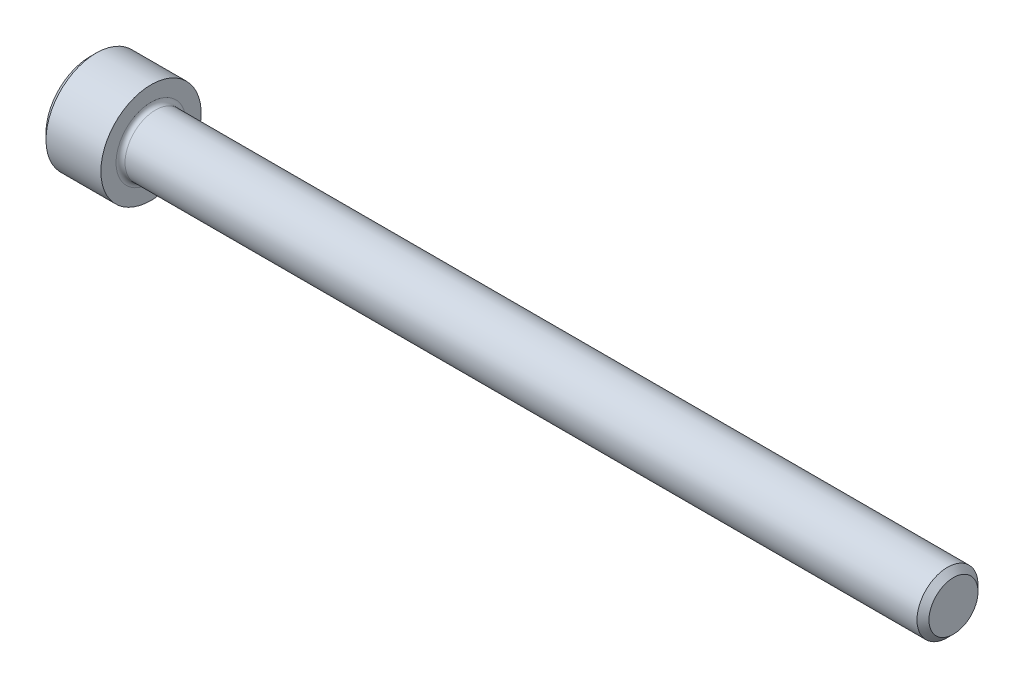
ISO-10303-21;
HEADER;
FILE_DESCRIPTION(('STEP AP214'),'2;1');
FILE_NAME('part.step','',(''),(''),'','','');
FILE_SCHEMA(('AUTOMOTIVE_DESIGN { 1 0 10303 214 1 1 1 1 }'));
ENDSEC;
DATA;
#1=APPLICATION_CONTEXT('core data for automotive mechanical design processes');
#2=APPLICATION_PROTOCOL_DEFINITION('international standard','automotive_design',2000,#1);
#3=PRODUCT_CONTEXT('',#1,'mechanical');
#4=PRODUCT('Part','Part','',(#3));
#5=PRODUCT_RELATED_PRODUCT_CATEGORY('part','',(#4));
#6=PRODUCT_DEFINITION_FORMATION('','',#4);
#7=PRODUCT_DEFINITION_CONTEXT('part definition',#1,'design');
#8=PRODUCT_DEFINITION('design','',#6,#7);
#9=PRODUCT_DEFINITION_SHAPE('','',#8);
#10=(LENGTH_UNIT() NAMED_UNIT(*) SI_UNIT(.MILLI.,.METRE.));
#11=(NAMED_UNIT(*) PLANE_ANGLE_UNIT() SI_UNIT($,.RADIAN.));
#12=(NAMED_UNIT(*) SI_UNIT($,.STERADIAN.) SOLID_ANGLE_UNIT());
#13=UNCERTAINTY_MEASURE_WITH_UNIT(LENGTH_MEASURE(1.E-05),#10,'distance_accuracy_value','');
#14=(GEOMETRIC_REPRESENTATION_CONTEXT(3) GLOBAL_UNCERTAINTY_ASSIGNED_CONTEXT((#13)) GLOBAL_UNIT_ASSIGNED_CONTEXT((#10,
#11,#12)) REPRESENTATION_CONTEXT('',''));
#15=CARTESIAN_POINT('',(0.,0.,0.));
#16=DIRECTION('',(0.,0.,1.));
#17=DIRECTION('',(1.,0.,0.));
#18=AXIS2_PLACEMENT_3D('',#15,#16,#17);
#19=CARTESIAN_POINT('',(2.286,1.14604605784411,1.98501));
#20=DIRECTION('',(-1.,0.,0.));
#21=DIRECTION('',(0.,0.,1.));
#22=AXIS2_PLACEMENT_3D('',#19,#20,#21);
#23=PLANE('',#22);
#24=DIRECTION('',(0.,0.500000000000001,0.866025403784438));
#25=VECTOR('',#24,1.);
#26=CARTESIAN_POINT('',(2.286,-1.71906908676614,0.992505));
#27=LINE('',#26,#25);
#28=CARTESIAN_POINT('',(2.2859999999804,-1.71906908679011,0.992505000013839));
#29=VERTEX_POINT('',#28);
#30=CARTESIAN_POINT('',(2.286,-1.14604605784409,1.98501));
#31=VERTEX_POINT('',#30);
#32=EDGE_CURVE('E101',#29,#31,#27,.T.);
#33=ORIENTED_EDGE('',*,*,#32,.T.);
#34=DIRECTION('',(0.,1.,0.));
#35=VECTOR('',#34,1.);
#36=CARTESIAN_POINT('',(2.286,1.14604605784411,1.98501));
#37=LINE('',#36,#35);
#38=CARTESIAN_POINT('',(2.28599999998701,0.,1.98501000001309));
#39=VERTEX_POINT('',#38);
#40=EDGE_CURVE('E96',#31,#39,#37,.T.);
#41=ORIENTED_EDGE('',*,*,#40,.T.);
#42=CARTESIAN_POINT('',(2.2859999999608,0.,0.));
#43=DIRECTION('',(-1.,0.,0.));
#44=DIRECTION('',(0.,0.,1.));
#45=AXIS2_PLACEMENT_3D('',#42,#43,#44);
#46=CIRCLE('',#45,1.98501000005535);
#47=EDGE_CURVE('E98',#39,#29,#46,.F.);
#48=ORIENTED_EDGE('',*,*,#47,.T.);
#49=EDGE_LOOP('',(#33,#41,#48));
#50=FACE_BOUND('',#49,.T.);
#51=ADVANCED_FACE('F17',(#50),#23,.T.);
#52=CARTESIAN_POINT('',(2.286,1.14604605784411,1.98501));
#53=DIRECTION('',(-1.,0.,0.));
#54=DIRECTION('',(0.,0.,1.));
#55=AXIS2_PLACEMENT_3D('',#52,#53,#54);
#56=PLANE('',#55);
#57=DIRECTION('',(0.,-0.499999999999998,0.86602540378444));
#58=VECTOR('',#57,1.);
#59=CARTESIAN_POINT('',(2.286,-1.71906908676615,-0.992504999999996));
#60=LINE('',#59,#58);
#61=CARTESIAN_POINT('',(2.2859999999804,-1.71906908679012,-0.992505000013836));
#62=VERTEX_POINT('',#61);
#63=CARTESIAN_POINT('',(2.286,-2.29209211568819,0.));
#64=VERTEX_POINT('',#63);
#65=EDGE_CURVE('E105',#62,#64,#60,.T.);
#66=ORIENTED_EDGE('',*,*,#65,.T.);
#67=DIRECTION('',(0.,0.500000000000001,0.866025403784438));
#68=VECTOR('',#67,1.);
#69=CARTESIAN_POINT('',(2.286,-2.29209211568819,0.));
#70=LINE('',#69,#68);
#71=EDGE_CURVE('E172',#64,#29,#70,.T.);
#72=ORIENTED_EDGE('',*,*,#71,.T.);
#73=CARTESIAN_POINT('',(2.2859999999608,0.,0.));
#74=DIRECTION('',(-1.,0.,0.));
#75=DIRECTION('',(0.,0.,1.));
#76=AXIS2_PLACEMENT_3D('',#73,#74,#75);
#77=CIRCLE('',#76,1.98501000005535);
#78=EDGE_CURVE('E117',#29,#62,#77,.F.);
#79=ORIENTED_EDGE('',*,*,#78,.T.);
#80=EDGE_LOOP('',(#66,#72,#79));
#81=FACE_BOUND('',#80,.T.);
#82=ADVANCED_FACE('F348',(#81),#56,.T.);
#83=CARTESIAN_POINT('',(2.286,1.14604605784411,1.98501));
#84=DIRECTION('',(-1.,0.,0.));
#85=DIRECTION('',(0.,0.,1.));
#86=AXIS2_PLACEMENT_3D('',#83,#84,#85);
#87=PLANE('',#86);
#88=DIRECTION('',(0.,1.,0.));
#89=VECTOR('',#88,1.);
#90=CARTESIAN_POINT('',(2.286,1.14604605784411,-1.98501));
#91=LINE('',#90,#89);
#92=CARTESIAN_POINT('',(2.28599999998701,0.,-1.98501000001309));
#93=VERTEX_POINT('',#92);
#94=CARTESIAN_POINT('',(2.286,-1.1460460578441,-1.98501));
#95=VERTEX_POINT('',#94);
#96=EDGE_CURVE('E167',#93,#95,#91,.F.);
#97=ORIENTED_EDGE('',*,*,#96,.T.);
#98=DIRECTION('',(0.,-0.499999999999999,0.866025403784439));
#99=VECTOR('',#98,1.);
#100=CARTESIAN_POINT('',(2.286,-1.1460460578441,-1.98501));
#101=LINE('',#100,#99);
#102=EDGE_CURVE('E162',#95,#62,#101,.T.);
#103=ORIENTED_EDGE('',*,*,#102,.T.);
#104=CARTESIAN_POINT('',(2.2859999999608,0.,0.));
#105=DIRECTION('',(-1.,0.,0.));
#106=DIRECTION('',(0.,0.,1.));
#107=AXIS2_PLACEMENT_3D('',#104,#105,#106);
#108=CIRCLE('',#107,1.98501000005535);
#109=EDGE_CURVE('E225',#62,#93,#108,.F.);
#110=ORIENTED_EDGE('',*,*,#109,.T.);
#111=EDGE_LOOP('',(#97,#103,#110));
#112=FACE_BOUND('',#111,.T.);
#113=ADVANCED_FACE('F345',(#112),#87,.T.);
#114=CARTESIAN_POINT('',(2.286,1.14604605784411,1.98501));
#115=DIRECTION('',(-1.,0.,0.));
#116=DIRECTION('',(0.,0.,1.));
#117=AXIS2_PLACEMENT_3D('',#114,#115,#116);
#118=PLANE('',#117);
#119=DIRECTION('',(0.,-0.500000000000001,-0.866025403784438));
#120=VECTOR('',#119,1.);
#121=CARTESIAN_POINT('',(2.286,1.71906908676615,-0.992505000000006));
#122=LINE('',#121,#120);
#123=CARTESIAN_POINT('',(2.2859999999804,1.71906908679012,-0.992505000013843));
#124=VERTEX_POINT('',#123);
#125=CARTESIAN_POINT('',(2.286,1.1460460578441,-1.98501));
#126=VERTEX_POINT('',#125);
#127=EDGE_CURVE('E157',#124,#126,#122,.T.);
#128=ORIENTED_EDGE('',*,*,#127,.T.);
#129=DIRECTION('',(0.,1.,0.));
#130=VECTOR('',#129,1.);
#131=CARTESIAN_POINT('',(2.286,1.14604605784411,-1.98501));
#132=LINE('',#131,#130);
#133=EDGE_CURVE('E152',#126,#93,#132,.F.);
#134=ORIENTED_EDGE('',*,*,#133,.T.);
#135=CARTESIAN_POINT('',(2.2859999999608,0.,0.));
#136=DIRECTION('',(-1.,0.,0.));
#137=DIRECTION('',(0.,0.,1.));
#138=AXIS2_PLACEMENT_3D('',#135,#136,#137);
#139=CIRCLE('',#138,1.98501000005535);
#140=EDGE_CURVE('E222',#93,#124,#139,.F.);
#141=ORIENTED_EDGE('',*,*,#140,.T.);
#142=EDGE_LOOP('',(#128,#134,#141));
#143=FACE_BOUND('',#142,.T.);
#144=ADVANCED_FACE('F341',(#143),#118,.T.);
#145=CARTESIAN_POINT('',(2.286,1.14604605784411,1.98501));
#146=DIRECTION('',(-1.,0.,0.));
#147=DIRECTION('',(0.,0.,1.));
#148=AXIS2_PLACEMENT_3D('',#145,#146,#147);
#149=PLANE('',#148);
#150=DIRECTION('',(0.,0.500000000000002,-0.866025403784437));
#151=VECTOR('',#150,1.);
#152=CARTESIAN_POINT('',(2.286,1.71906908676615,0.992504999999996));
#153=LINE('',#152,#151);
#154=CARTESIAN_POINT('',(2.2859999999804,1.71906908679012,0.992505000013835));
#155=VERTEX_POINT('',#154);
#156=CARTESIAN_POINT('',(2.286,2.2920921156882,0.));
#157=VERTEX_POINT('',#156);
#158=EDGE_CURVE('E147',#155,#157,#153,.T.);
#159=ORIENTED_EDGE('',*,*,#158,.T.);
#160=DIRECTION('',(0.,-0.500000000000002,-0.866025403784437));
#161=VECTOR('',#160,1.);
#162=CARTESIAN_POINT('',(2.286,2.2920921156882,0.));
#163=LINE('',#162,#161);
#164=EDGE_CURVE('E118',#157,#124,#163,.T.);
#165=ORIENTED_EDGE('',*,*,#164,.T.);
#166=CARTESIAN_POINT('',(2.2859999999608,0.,0.));
#167=DIRECTION('',(-1.,0.,0.));
#168=DIRECTION('',(0.,0.,1.));
#169=AXIS2_PLACEMENT_3D('',#166,#167,#168);
#170=CIRCLE('',#169,1.98501000005535);
#171=EDGE_CURVE('E125',#124,#155,#170,.F.);
#172=ORIENTED_EDGE('',*,*,#171,.T.);
#173=EDGE_LOOP('',(#159,#165,#172));
#174=FACE_BOUND('',#173,.T.);
#175=ADVANCED_FACE('F337',(#174),#149,.T.);
#176=CARTESIAN_POINT('',(2.28600000002643,0.,0.));
#177=DIRECTION('',(-1.,0.,0.));
#178=DIRECTION('',(0.,0.,1.));
#179=AXIS2_PLACEMENT_3D('',#176,#177,#178);
#180=CONICAL_SURFACE('',#179,1.98500999994167,1.04719755112655);
#181=CARTESIAN_POINT('',(3.43204605781011,0.,5.6843418860808E-11));
#182=VERTEX_POINT('',#181);
#183=VERTEX_LOOP('',#182);
#184=FACE_BOUND('',#183,.T.);
#185=ORIENTED_EDGE('',*,*,#47,.F.);
#186=CARTESIAN_POINT('',(2.2859999999608,0.,0.));
#187=DIRECTION('',(-1.,0.,0.));
#188=DIRECTION('',(0.,0.,1.));
#189=AXIS2_PLACEMENT_3D('',#186,#187,#188);
#190=CIRCLE('',#189,1.98501000005535);
#191=EDGE_CURVE('E113',#155,#39,#190,.F.);
#192=ORIENTED_EDGE('',*,*,#191,.F.);
#193=ORIENTED_EDGE('',*,*,#171,.F.);
#194=ORIENTED_EDGE('',*,*,#140,.F.);
#195=ORIENTED_EDGE('',*,*,#109,.F.);
#196=ORIENTED_EDGE('',*,*,#78,.F.);
#197=EDGE_LOOP('',(#185,#192,#193,#194,#195,#196));
#198=FACE_BOUND('',#197,.T.);
#199=ADVANCED_FACE('F111',(#184,#198),#180,.F.);
#200=CARTESIAN_POINT('',(2.286,1.14604605784411,1.98501));
#201=DIRECTION('',(-1.,0.,0.));
#202=DIRECTION('',(0.,0.,1.));
#203=AXIS2_PLACEMENT_3D('',#200,#201,#202);
#204=PLANE('',#203);
#205=DIRECTION('',(0.,-1.,0.));
#206=VECTOR('',#205,1.);
#207=CARTESIAN_POINT('',(2.286,-1.14604605784409,1.98501));
#208=LINE('',#207,#206);
#209=CARTESIAN_POINT('',(2.286,1.14604605784411,1.98501));
#210=VERTEX_POINT('',#209);
#211=EDGE_CURVE('E122',#39,#210,#208,.F.);
#212=ORIENTED_EDGE('',*,*,#211,.T.);
#213=DIRECTION('',(0.,0.499999999999998,-0.86602540378444));
#214=VECTOR('',#213,1.);
#215=CARTESIAN_POINT('',(2.286,2.2920921156882,0.));
#216=LINE('',#215,#214);
#217=EDGE_CURVE('E124',#155,#210,#216,.F.);
#218=ORIENTED_EDGE('',*,*,#217,.F.);
#219=ORIENTED_EDGE('',*,*,#191,.T.);
#220=EDGE_LOOP('',(#212,#218,#219));
#221=FACE_BOUND('',#220,.T.);
#222=ADVANCED_FACE('F121',(#221),#204,.T.);
#223=CARTESIAN_POINT('',(2.286,2.2920921156882,0.));
#224=DIRECTION('',(0.,-0.86602540378444,-0.499999999999998));
#225=DIRECTION('',(0.,0.499999999999998,-0.86602540378444));
#226=AXIS2_PLACEMENT_3D('',#223,#224,#225);
#227=PLANE('',#226);
#228=ORIENTED_EDGE('',*,*,#217,.T.);
#229=DIRECTION('',(1.,0.,0.));
#230=VECTOR('',#229,1.);
#231=CARTESIAN_POINT('',(2.286,1.14604605784411,1.98501));
#232=LINE('',#231,#230);
#233=CARTESIAN_POINT('',(0.,1.14604605784411,1.98501));
#234=VERTEX_POINT('',#233);
#235=EDGE_CURVE('E130',#210,#234,#232,.F.);
#236=ORIENTED_EDGE('',*,*,#235,.T.);
#237=DIRECTION('',(0.,-0.499999999999998,0.86602540378444));
#238=VECTOR('',#237,1.);
#239=CARTESIAN_POINT('',(0.,2.2920921156882,0.));
#240=LINE('',#239,#238);
#241=CARTESIAN_POINT('',(0.,2.2920921156882,0.));
#242=VERTEX_POINT('',#241);
#243=EDGE_CURVE('E137',#242,#234,#240,.T.);
#244=ORIENTED_EDGE('',*,*,#243,.F.);
#245=DIRECTION('',(1.,0.,0.));
#246=VECTOR('',#245,1.);
#247=CARTESIAN_POINT('',(2.286,2.2920921156882,0.));
#248=LINE('',#247,#246);
#249=EDGE_CURVE('E187',#242,#157,#248,.T.);
#250=ORIENTED_EDGE('',*,*,#249,.T.);
#251=ORIENTED_EDGE('',*,*,#158,.F.);
#252=EDGE_LOOP('',(#228,#236,#244,#250,#251));
#253=FACE_BOUND('',#252,.T.);
#254=ADVANCED_FACE('F329',(#253),#227,.T.);
#255=CARTESIAN_POINT('',(2.286,-1.14604605784409,1.98501));
#256=DIRECTION('',(0.,0.,1.));
#257=DIRECTION('',(0.,-1.,0.));
#258=AXIS2_PLACEMENT_3D('',#255,#256,#257);
#259=PLANE('',#258);
#260=ORIENTED_EDGE('',*,*,#235,.F.);
#261=ORIENTED_EDGE('',*,*,#211,.F.);
#262=ORIENTED_EDGE('',*,*,#40,.F.);
#263=DIRECTION('',(1.,0.,0.));
#264=VECTOR('',#263,1.);
#265=CARTESIAN_POINT('',(2.286,-1.14604605784409,1.98501));
#266=LINE('',#265,#264);
#267=CARTESIAN_POINT('',(0.,-1.14604605784409,1.98501));
#268=VERTEX_POINT('',#267);
#269=EDGE_CURVE('E132',#268,#31,#266,.T.);
#270=ORIENTED_EDGE('',*,*,#269,.F.);
#271=DIRECTION('',(0.,1.,0.));
#272=VECTOR('',#271,1.);
#273=CARTESIAN_POINT('',(0.,0.,1.98501));
#274=LINE('',#273,#272);
#275=EDGE_CURVE('E363',#234,#268,#274,.F.);
#276=ORIENTED_EDGE('',*,*,#275,.F.);
#277=EDGE_LOOP('',(#260,#261,#262,#270,#276));
#278=FACE_BOUND('',#277,.T.);
#279=ADVANCED_FACE('F128',(#278),#259,.F.);
#280=CARTESIAN_POINT('',(2.286,-1.14604605784409,1.98501));
#281=DIRECTION('',(0.,0.866025403784438,-0.500000000000001));
#282=DIRECTION('',(0.,0.500000000000001,0.866025403784438));
#283=AXIS2_PLACEMENT_3D('',#280,#281,#282);
#284=PLANE('',#283);
#285=ORIENTED_EDGE('',*,*,#71,.F.);
#286=DIRECTION('',(1.,0.,0.));
#287=VECTOR('',#286,1.);
#288=CARTESIAN_POINT('',(2.286,-2.29209211568819,0.));
#289=LINE('',#288,#287);
#290=CARTESIAN_POINT('',(0.,-2.29209211568819,0.));
#291=VERTEX_POINT('',#290);
#292=EDGE_CURVE('E198',#291,#64,#289,.T.);
#293=ORIENTED_EDGE('',*,*,#292,.F.);
#294=DIRECTION('',(0.,-0.500000000000001,-0.866025403784438));
#295=VECTOR('',#294,1.);
#296=CARTESIAN_POINT('',(0.,-1.14604605784409,1.98501));
#297=LINE('',#296,#295);
#298=EDGE_CURVE('E361',#268,#291,#297,.T.);
#299=ORIENTED_EDGE('',*,*,#298,.F.);
#300=ORIENTED_EDGE('',*,*,#269,.T.);
#301=ORIENTED_EDGE('',*,*,#32,.F.);
#302=EDGE_LOOP('',(#285,#293,#299,#300,#301));
#303=FACE_BOUND('',#302,.T.);
#304=ADVANCED_FACE('F322',(#303),#284,.T.);
#305=CARTESIAN_POINT('',(2.286,-2.29209211568819,0.));
#306=DIRECTION('',(0.,0.866025403784439,0.499999999999999));
#307=DIRECTION('',(0.,-0.499999999999999,0.866025403784439));
#308=AXIS2_PLACEMENT_3D('',#305,#306,#307);
#309=PLANE('',#308);
#310=ORIENTED_EDGE('',*,*,#102,.F.);
#311=DIRECTION('',(1.,0.,0.));
#312=VECTOR('',#311,1.);
#313=CARTESIAN_POINT('',(2.286,-1.1460460578441,-1.98501));
#314=LINE('',#313,#312);
#315=CARTESIAN_POINT('',(0.,-1.1460460578441,-1.98501));
#316=VERTEX_POINT('',#315);
#317=EDGE_CURVE('E191',#95,#316,#314,.F.);
#318=ORIENTED_EDGE('',*,*,#317,.T.);
#319=DIRECTION('',(0.,0.499999999999999,-0.86602540378444));
#320=VECTOR('',#319,1.);
#321=CARTESIAN_POINT('',(0.,-2.29209211568819,0.));
#322=LINE('',#321,#320);
#323=EDGE_CURVE('E358',#291,#316,#322,.T.);
#324=ORIENTED_EDGE('',*,*,#323,.F.);
#325=ORIENTED_EDGE('',*,*,#292,.T.);
#326=ORIENTED_EDGE('',*,*,#65,.F.);
#327=EDGE_LOOP('',(#310,#318,#324,#325,#326));
#328=FACE_BOUND('',#327,.T.);
#329=ADVANCED_FACE('F318',(#328),#309,.T.);
#330=CARTESIAN_POINT('',(2.286,1.1460460578441,-1.98501));
#331=DIRECTION('',(0.,0.,-1.));
#332=DIRECTION('',(0.,1.,0.));
#333=AXIS2_PLACEMENT_3D('',#330,#331,#332);
#334=PLANE('',#333);
#335=ORIENTED_EDGE('',*,*,#317,.F.);
#336=ORIENTED_EDGE('',*,*,#96,.F.);
#337=ORIENTED_EDGE('',*,*,#133,.F.);
#338=DIRECTION('',(1.,0.,0.));
#339=VECTOR('',#338,1.);
#340=CARTESIAN_POINT('',(2.286,1.1460460578441,-1.98501));
#341=LINE('',#340,#339);
#342=CARTESIAN_POINT('',(0.,1.1460460578441,-1.98501));
#343=VERTEX_POINT('',#342);
#344=EDGE_CURVE('E190',#126,#343,#341,.F.);
#345=ORIENTED_EDGE('',*,*,#344,.T.);
#346=DIRECTION('',(0.,1.,0.));
#347=VECTOR('',#346,1.);
#348=CARTESIAN_POINT('',(0.,0.,-1.98501));
#349=LINE('',#348,#347);
#350=EDGE_CURVE('E373',#316,#343,#349,.T.);
#351=ORIENTED_EDGE('',*,*,#350,.F.);
#352=EDGE_LOOP('',(#335,#336,#337,#345,#351));
#353=FACE_BOUND('',#352,.T.);
#354=ADVANCED_FACE('F314',(#353),#334,.F.);
#355=CARTESIAN_POINT('',(2.286,2.2920921156882,0.));
#356=DIRECTION('',(0.,0.866025403784438,-0.500000000000002));
#357=DIRECTION('',(0.,0.500000000000002,0.866025403784438));
#358=AXIS2_PLACEMENT_3D('',#355,#356,#357);
#359=PLANE('',#358);
#360=ORIENTED_EDGE('',*,*,#344,.F.);
#361=ORIENTED_EDGE('',*,*,#127,.F.);
#362=ORIENTED_EDGE('',*,*,#164,.F.);
#363=ORIENTED_EDGE('',*,*,#249,.F.);
#364=DIRECTION('',(0.,0.500000000000002,0.866025403784438));
#365=VECTOR('',#364,1.);
#366=CARTESIAN_POINT('',(0.,1.1460460578441,-1.98501));
#367=LINE('',#366,#365);
#368=EDGE_CURVE('E218',#343,#242,#367,.T.);
#369=ORIENTED_EDGE('',*,*,#368,.F.);
#370=EDGE_LOOP('',(#360,#361,#362,#363,#369));
#371=FACE_BOUND('',#370,.T.);
#372=ADVANCED_FACE('F310',(#371),#359,.F.);
#373=CARTESIAN_POINT('',(0.,0.,0.));
#374=DIRECTION('',(-1.,0.,0.));
#375=DIRECTION('',(0.,0.,1.));
#376=AXIS2_PLACEMENT_3D('',#373,#374,#375);
#377=PLANE('',#376);
#378=CARTESIAN_POINT('',(-5.6843418860808E-11,0.,0.));
#379=DIRECTION('',(1.,0.,0.));
#380=DIRECTION('',(0.,1.,0.));
#381=AXIS2_PLACEMENT_3D('',#378,#379,#380);
#382=CIRCLE('',#381,3.48615000001473);
#383=CARTESIAN_POINT('',(-5.68434426698877E-11,3.48615000001473,0.));
#384=VERTEX_POINT('',#383);
#385=EDGE_CURVE('E216',#384,#384,#382,.T.);
#386=ORIENTED_EDGE('',*,*,#385,.F.);
#387=EDGE_LOOP('',(#386));
#388=FACE_BOUND('',#387,.T.);
#389=ORIENTED_EDGE('',*,*,#350,.T.);
#390=ORIENTED_EDGE('',*,*,#368,.T.);
#391=ORIENTED_EDGE('',*,*,#243,.T.);
#392=ORIENTED_EDGE('',*,*,#275,.T.);
#393=ORIENTED_EDGE('',*,*,#298,.T.);
#394=ORIENTED_EDGE('',*,*,#323,.T.);
#395=EDGE_LOOP('',(#389,#390,#391,#392,#393,#394));
#396=FACE_BOUND('',#395,.T.);
#397=ADVANCED_FACE('F302',(#388,#396),#377,.T.);
#398=CARTESIAN_POINT('',(0.482599999998001,0.,0.));
#399=DIRECTION('',(1.,0.,0.));
#400=DIRECTION('',(0.,1.,0.));
#401=AXIS2_PLACEMENT_3D('',#398,#399,#400);
#402=CONICAL_SURFACE('',#401,3.96875000006958,0.785398163397448);
#403=ORIENTED_EDGE('',*,*,#385,.T.);
#404=EDGE_LOOP('',(#403));
#405=FACE_BOUND('',#404,.T.);
#406=CARTESIAN_POINT('',(0.4826,0.,0.));
#407=DIRECTION('',(-1.,0.,0.));
#408=DIRECTION('',(0.,0.,1.));
#409=AXIS2_PLACEMENT_3D('',#406,#407,#408);
#410=CIRCLE('',#409,3.96875);
#411=CARTESIAN_POINT('',(0.4826,0.,3.96875));
#412=VERTEX_POINT('',#411);
#413=EDGE_CURVE('E215',#412,#412,#410,.F.);
#414=ORIENTED_EDGE('',*,*,#413,.F.);
#415=EDGE_LOOP('',(#414));
#416=FACE_BOUND('',#415,.T.);
#417=ADVANCED_FACE('F297',(#405,#416),#402,.T.);
#418=CARTESIAN_POINT('',(-31.75,0.,0.));
#419=DIRECTION('',(-1.,0.,0.));
#420=DIRECTION('',(0.,0.,1.));
#421=AXIS2_PLACEMENT_3D('',#418,#419,#420);
#422=CYLINDRICAL_SURFACE('',#421,3.96875);
#423=CARTESIAN_POINT('',(4.826,0.,0.));
#424=DIRECTION('',(-1.,0.,0.));
#425=DIRECTION('',(0.,0.,1.));
#426=AXIS2_PLACEMENT_3D('',#423,#424,#425);
#427=CIRCLE('',#426,3.96875);
#428=CARTESIAN_POINT('',(4.826,0.,3.96875));
#429=VERTEX_POINT('',#428);
#430=EDGE_CURVE('E212',#429,#429,#427,.F.);
#431=ORIENTED_EDGE('',*,*,#430,.F.);
#432=EDGE_LOOP('',(#431));
#433=FACE_BOUND('',#432,.T.);
#434=ORIENTED_EDGE('',*,*,#413,.T.);
#435=EDGE_LOOP('',(#434));
#436=FACE_BOUND('',#435,.T.);
#437=ADVANCED_FACE('F293',(#433,#436),#422,.T.);
#438=CARTESIAN_POINT('',(68.326,1.94056,0.));
#439=DIRECTION('',(1.,0.,0.));
#440=DIRECTION('',(0.,0.,-1.));
#441=AXIS2_PLACEMENT_3D('',#438,#439,#440);
#442=PLANE('',#441);
#443=CARTESIAN_POINT('',(68.3260000000132,0.,0.));
#444=DIRECTION('',(-1.,0.,0.));
#445=DIRECTION('',(0.,0.,1.));
#446=AXIS2_PLACEMENT_3D('',#443,#444,#445);
#447=CIRCLE('',#446,1.94055999998);
#448=CARTESIAN_POINT('',(68.3260000000132,0.,1.94055999998));
#449=VERTEX_POINT('',#448);
#450=EDGE_CURVE('E208',#449,#449,#447,.T.);
#451=ORIENTED_EDGE('',*,*,#450,.F.);
#452=EDGE_LOOP('',(#451));
#453=FACE_BOUND('',#452,.T.);
#454=ADVANCED_FACE('F251',(#453),#442,.T.);
#455=CARTESIAN_POINT('',(4.826,3.96875,0.));
#456=DIRECTION('',(1.,0.,0.));
#457=DIRECTION('',(0.,0.,-1.));
#458=AXIS2_PLACEMENT_3D('',#455,#456,#457);
#459=PLANE('',#458);
#460=ORIENTED_EDGE('',*,*,#430,.T.);
#461=EDGE_LOOP('',(#460));
#462=FACE_BOUND('',#461,.T.);
#463=CARTESIAN_POINT('',(4.826,0.,0.));
#464=DIRECTION('',(1.,0.,0.));
#465=DIRECTION('',(0.,0.,1.));
#466=AXIS2_PLACEMENT_3D('',#463,#464,#465);
#467=CIRCLE('',#466,2.76859999999997);
#468=CARTESIAN_POINT('',(4.826,0.,-2.76859999999997));
#469=VERTEX_POINT('',#468);
#470=CARTESIAN_POINT('',(4.826,0.,2.76859999999997));
#471=VERTEX_POINT('',#470);
#472=EDGE_CURVE('E211',#469,#471,#467,.F.);
#473=ORIENTED_EDGE('',*,*,#472,.T.);
#474=CARTESIAN_POINT('',(4.826,0.,0.));
#475=DIRECTION('',(1.,0.,0.));
#476=DIRECTION('',(0.,0.,-1.));
#477=AXIS2_PLACEMENT_3D('',#474,#475,#476);
#478=CIRCLE('',#477,2.76859999999997);
#479=EDGE_CURVE('E36',#471,#469,#478,.F.);
#480=ORIENTED_EDGE('',*,*,#479,.T.);
#481=EDGE_LOOP('',(#473,#480));
#482=FACE_BOUND('',#481,.T.);
#483=ADVANCED_FACE('F232',(#462,#482),#459,.T.);
#484=CARTESIAN_POINT('',(67.85356000006,0.,0.));
#485=DIRECTION('',(-1.,0.,0.));
#486=DIRECTION('',(0.,0.,1.));
#487=AXIS2_PLACEMENT_3D('',#484,#485,#486);
#488=CONICAL_SURFACE('',#487,2.41299999993316,0.785398163397448);
#489=CARTESIAN_POINT('',(67.8535599999999,0.,0.));
#490=DIRECTION('',(-1.,0.,0.));
#491=DIRECTION('',(0.,0.,1.));
#492=AXIS2_PLACEMENT_3D('',#489,#490,#491);
#493=CIRCLE('',#492,2.41299999999997);
#494=CARTESIAN_POINT('',(67.8535599999999,0.,2.41299999999997));
#495=VERTEX_POINT('',#494);
#496=EDGE_CURVE('E28',#495,#495,#493,.T.);
#497=ORIENTED_EDGE('',*,*,#496,.F.);
#498=EDGE_LOOP('',(#497));
#499=FACE_BOUND('',#498,.T.);
#500=ORIENTED_EDGE('',*,*,#450,.T.);
#501=EDGE_LOOP('',(#500));
#502=FACE_BOUND('',#501,.T.);
#503=ADVANCED_FACE('F250',(#499,#502),#488,.T.);
#504=CARTESIAN_POINT('',(5.1816,0.,0.));
#505=DIRECTION('',(1.,0.,0.));
#506=DIRECTION('',(0.,0.,-1.));
#507=AXIS2_PLACEMENT_3D('',#504,#505,#506);
#508=TOROIDAL_SURFACE('',#507,2.76859999999997,0.3556);
#509=CARTESIAN_POINT('',(5.1816,0.,0.));
#510=DIRECTION('',(-1.,0.,0.));
#511=DIRECTION('',(0.,0.,1.));
#512=AXIS2_PLACEMENT_3D('',#509,#510,#511);
#513=CIRCLE('',#512,2.41299999999997);
#514=CARTESIAN_POINT('',(5.1816,0.,2.41299999999997));
#515=VERTEX_POINT('',#514);
#516=EDGE_CURVE('E11',#515,#515,#513,.F.);
#517=ORIENTED_EDGE('',*,*,#516,.F.);
#518=EDGE_LOOP('',(#517));
#519=FACE_BOUND('',#518,.T.);
#520=ORIENTED_EDGE('',*,*,#472,.F.);
#521=ORIENTED_EDGE('',*,*,#479,.F.);
#522=EDGE_LOOP('',(#520,#521));
#523=FACE_BOUND('',#522,.T.);
#524=ADVANCED_FACE('F229',(#519,#523),#508,.F.);
#525=CARTESIAN_POINT('',(-31.75,0.,0.));
#526=DIRECTION('',(-1.,0.,0.));
#527=DIRECTION('',(0.,0.,1.));
#528=AXIS2_PLACEMENT_3D('',#525,#526,#527);
#529=CYLINDRICAL_SURFACE('',#528,2.41299999999997);
#530=ORIENTED_EDGE('',*,*,#516,.T.);
#531=EDGE_LOOP('',(#530));
#532=FACE_BOUND('',#531,.T.);
#533=ORIENTED_EDGE('',*,*,#496,.T.);
#534=EDGE_LOOP('',(#533));
#535=FACE_BOUND('',#534,.T.);
#536=ADVANCED_FACE('F275',(#532,#535),#529,.T.);
#537=CLOSED_SHELL('',(#51,#82,#113,#144,#175,#199,#222,#254,#279,#304,#329,#354,#372,#397,#417,
#437,#454,#483,#503,#524,#536));
#538=MANIFOLD_SOLID_BREP('B1',#537);
#539=ADVANCED_BREP_SHAPE_REPRESENTATION('',(#18,#538),#14);
#540=SHAPE_DEFINITION_REPRESENTATION(#9,#539);
ENDSEC;
END-ISO-10303-21;
